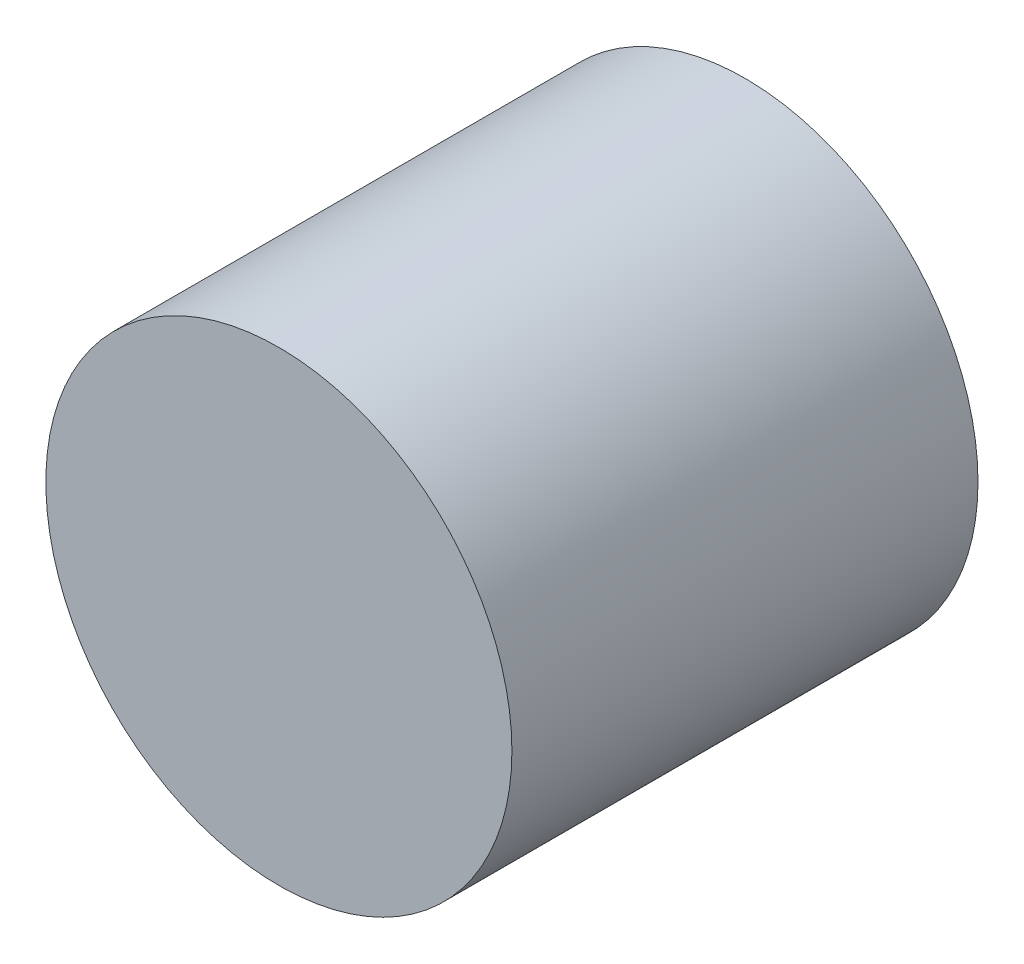
ISO-10303-21;
HEADER;
FILE_DESCRIPTION(('STEP AP214'),'2;1');
FILE_NAME('part.step','',(''),(''),'','','');
FILE_SCHEMA(('AUTOMOTIVE_DESIGN { 1 0 10303 214 1 1 1 1 }'));
ENDSEC;
DATA;
#1=APPLICATION_CONTEXT('core data for automotive mechanical design processes');
#2=APPLICATION_PROTOCOL_DEFINITION('international standard','automotive_design',2000,#1);
#3=PRODUCT_CONTEXT('',#1,'mechanical');
#4=PRODUCT('Part','Part','',(#3));
#5=PRODUCT_RELATED_PRODUCT_CATEGORY('part','',(#4));
#6=PRODUCT_DEFINITION_FORMATION('','',#4);
#7=PRODUCT_DEFINITION_CONTEXT('part definition',#1,'design');
#8=PRODUCT_DEFINITION('design','',#6,#7);
#9=PRODUCT_DEFINITION_SHAPE('','',#8);
#10=(LENGTH_UNIT() NAMED_UNIT(*) SI_UNIT(.MILLI.,.METRE.));
#11=(NAMED_UNIT(*) PLANE_ANGLE_UNIT() SI_UNIT($,.RADIAN.));
#12=(NAMED_UNIT(*) SI_UNIT($,.STERADIAN.) SOLID_ANGLE_UNIT());
#13=UNCERTAINTY_MEASURE_WITH_UNIT(LENGTH_MEASURE(1.E-05),#10,'distance_accuracy_value','');
#14=(GEOMETRIC_REPRESENTATION_CONTEXT(3) GLOBAL_UNCERTAINTY_ASSIGNED_CONTEXT((#13)) GLOBAL_UNIT_ASSIGNED_CONTEXT((#10,
#11,#12)) REPRESENTATION_CONTEXT('',''));
#15=CARTESIAN_POINT('',(0.,0.,0.));
#16=DIRECTION('',(0.,0.,1.));
#17=DIRECTION('',(1.,0.,0.));
#18=AXIS2_PLACEMENT_3D('',#15,#16,#17);
#19=CARTESIAN_POINT('',(0.,0.,6.4));
#20=DIRECTION('',(0.,0.,-1.));
#21=DIRECTION('',(-1.,0.,0.));
#22=AXIS2_PLACEMENT_3D('',#19,#20,#21);
#23=CYLINDRICAL_SURFACE('',#22,3.19999999999999);
#24=CARTESIAN_POINT('',(0.,0.,6.4));
#25=DIRECTION('',(0.,0.,1.));
#26=DIRECTION('',(1.,0.,0.));
#27=AXIS2_PLACEMENT_3D('',#24,#25,#26);
#28=CIRCLE('',#27,3.19999999999999);
#29=CARTESIAN_POINT('',(3.19999999999999,0.,6.4));
#30=VERTEX_POINT('',#29);
#31=EDGE_CURVE('E10',#30,#30,#28,.T.);
#32=ORIENTED_EDGE('',*,*,#31,.F.);
#33=EDGE_LOOP('',(#32));
#34=FACE_BOUND('',#33,.T.);
#35=CARTESIAN_POINT('',(0.,0.,0.));
#36=DIRECTION('',(0.,0.,1.));
#37=DIRECTION('',(1.,0.,0.));
#38=AXIS2_PLACEMENT_3D('',#35,#36,#37);
#39=CIRCLE('',#38,3.19999999999999);
#40=CARTESIAN_POINT('',(3.19999999999999,0.,0.));
#41=VERTEX_POINT('',#40);
#42=EDGE_CURVE('E34',#41,#41,#39,.T.);
#43=ORIENTED_EDGE('',*,*,#42,.T.);
#44=EDGE_LOOP('',(#43));
#45=FACE_BOUND('',#44,.T.);
#46=ADVANCED_FACE('F31',(#34,#45),#23,.T.);
#47=CARTESIAN_POINT('',(0.,0.,6.4));
#48=DIRECTION('',(0.,0.,1.));
#49=DIRECTION('',(1.,0.,0.));
#50=AXIS2_PLACEMENT_3D('',#47,#48,#49);
#51=PLANE('',#50);
#52=ORIENTED_EDGE('',*,*,#31,.T.);
#53=EDGE_LOOP('',(#52));
#54=FACE_BOUND('',#53,.T.);
#55=ADVANCED_FACE('F46',(#54),#51,.T.);
#56=CARTESIAN_POINT('',(0.,0.,0.));
#57=DIRECTION('',(0.,0.,1.));
#58=DIRECTION('',(1.,0.,0.));
#59=AXIS2_PLACEMENT_3D('',#56,#57,#58);
#60=PLANE('',#59);
#61=ORIENTED_EDGE('',*,*,#42,.F.);
#62=EDGE_LOOP('',(#61));
#63=FACE_BOUND('',#62,.T.);
#64=ADVANCED_FACE('F44',(#63),#60,.F.);
#65=CLOSED_SHELL('',(#46,#55,#64));
#66=MANIFOLD_SOLID_BREP('B2',#65);
#67=ADVANCED_BREP_SHAPE_REPRESENTATION('',(#18,#66),#14);
#68=SHAPE_DEFINITION_REPRESENTATION(#9,#67);
ENDSEC;
END-ISO-10303-21;
